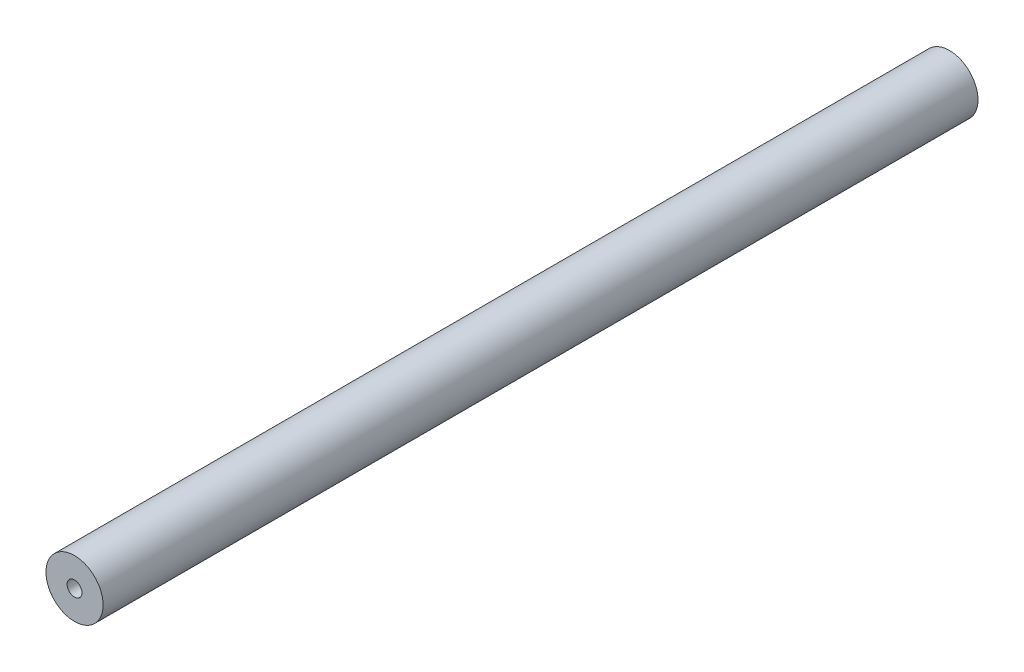
ISO-10303-21;
HEADER;
FILE_DESCRIPTION(('STEP AP214'),'2;1');
FILE_NAME('part.step','',(''),(''),'','','');
FILE_SCHEMA(('AUTOMOTIVE_DESIGN { 1 0 10303 214 1 1 1 1 }'));
ENDSEC;
DATA;
#1=APPLICATION_CONTEXT('core data for automotive mechanical design processes');
#2=APPLICATION_PROTOCOL_DEFINITION('international standard','automotive_design',2000,#1);
#3=PRODUCT_CONTEXT('',#1,'mechanical');
#4=PRODUCT('Part','Part','',(#3));
#5=PRODUCT_RELATED_PRODUCT_CATEGORY('part','',(#4));
#6=PRODUCT_DEFINITION_FORMATION('','',#4);
#7=PRODUCT_DEFINITION_CONTEXT('part definition',#1,'design');
#8=PRODUCT_DEFINITION('design','',#6,#7);
#9=PRODUCT_DEFINITION_SHAPE('','',#8);
#10=(LENGTH_UNIT() NAMED_UNIT(*) SI_UNIT(.MILLI.,.METRE.));
#11=(NAMED_UNIT(*) PLANE_ANGLE_UNIT() SI_UNIT($,.RADIAN.));
#12=(NAMED_UNIT(*) SI_UNIT($,.STERADIAN.) SOLID_ANGLE_UNIT());
#13=UNCERTAINTY_MEASURE_WITH_UNIT(LENGTH_MEASURE(1.E-05),#10,'distance_accuracy_value','');
#14=(GEOMETRIC_REPRESENTATION_CONTEXT(3) GLOBAL_UNCERTAINTY_ASSIGNED_CONTEXT((#13)) GLOBAL_UNIT_ASSIGNED_CONTEXT((#10,
#11,#12)) REPRESENTATION_CONTEXT('',''));
#15=CARTESIAN_POINT('',(0.,0.,0.));
#16=DIRECTION('',(0.,0.,1.));
#17=DIRECTION('',(1.,0.,0.));
#18=AXIS2_PLACEMENT_3D('',#15,#16,#17);
#19=CARTESIAN_POINT('',(0.,0.,233.3625));
#20=DIRECTION('',(0.,0.,1.));
#21=DIRECTION('',(1.,0.,0.));
#22=AXIS2_PLACEMENT_3D('',#19,#20,#21);
#23=PLANE('',#22);
#24=CARTESIAN_POINT('',(0.,0.,233.3625));
#25=DIRECTION('',(0.,0.,1.));
#26=DIRECTION('',(1.,0.,0.));
#27=AXIS2_PLACEMENT_3D('',#24,#25,#26);
#28=CIRCLE('',#27,15.24);
#29=CARTESIAN_POINT('',(15.24,0.,233.3625));
#30=VERTEX_POINT('',#29);
#31=EDGE_CURVE('E11',#30,#30,#28,.T.);
#32=ORIENTED_EDGE('',*,*,#31,.T.);
#33=EDGE_LOOP('',(#32));
#34=FACE_BOUND('',#33,.T.);
#35=CARTESIAN_POINT('',(0.,0.,233.3625));
#36=DIRECTION('',(0.,0.,1.));
#37=DIRECTION('',(1.,0.,0.));
#38=AXIS2_PLACEMENT_3D('',#35,#36,#37);
#39=CIRCLE('',#38,3.96875);
#40=CARTESIAN_POINT('',(3.96875,0.,233.3625));
#41=VERTEX_POINT('',#40);
#42=EDGE_CURVE('E48',#41,#41,#39,.T.);
#43=ORIENTED_EDGE('',*,*,#42,.F.);
#44=EDGE_LOOP('',(#43));
#45=FACE_BOUND('',#44,.T.);
#46=ADVANCED_FACE('F37',(#34,#45),#23,.T.);
#47=CARTESIAN_POINT('',(0.,0.,-233.3625));
#48=DIRECTION('',(0.,0.,1.));
#49=DIRECTION('',(1.,0.,0.));
#50=AXIS2_PLACEMENT_3D('',#47,#48,#49);
#51=PLANE('',#50);
#52=CARTESIAN_POINT('',(0.,0.,-233.3625));
#53=DIRECTION('',(0.,0.,1.));
#54=DIRECTION('',(1.,0.,0.));
#55=AXIS2_PLACEMENT_3D('',#52,#53,#54);
#56=CIRCLE('',#55,15.24);
#57=CARTESIAN_POINT('',(15.24,0.,-233.3625));
#58=VERTEX_POINT('',#57);
#59=EDGE_CURVE('E41',#58,#58,#56,.T.);
#60=ORIENTED_EDGE('',*,*,#59,.F.);
#61=EDGE_LOOP('',(#60));
#62=FACE_BOUND('',#61,.T.);
#63=CARTESIAN_POINT('',(0.,0.,-233.3625));
#64=DIRECTION('',(0.,0.,1.));
#65=DIRECTION('',(1.,0.,0.));
#66=AXIS2_PLACEMENT_3D('',#63,#64,#65);
#67=CIRCLE('',#66,3.96875);
#68=CARTESIAN_POINT('',(3.96875,0.,-233.3625));
#69=VERTEX_POINT('',#68);
#70=EDGE_CURVE('E50',#69,#69,#67,.T.);
#71=ORIENTED_EDGE('',*,*,#70,.T.);
#72=EDGE_LOOP('',(#71));
#73=FACE_BOUND('',#72,.T.);
#74=ADVANCED_FACE('F60',(#62,#73),#51,.F.);
#75=CARTESIAN_POINT('',(0.,0.,233.3625));
#76=DIRECTION('',(0.,0.,-1.));
#77=DIRECTION('',(-1.,0.,0.));
#78=AXIS2_PLACEMENT_3D('',#75,#76,#77);
#79=CYLINDRICAL_SURFACE('',#78,15.24);
#80=ORIENTED_EDGE('',*,*,#31,.F.);
#81=EDGE_LOOP('',(#80));
#82=FACE_BOUND('',#81,.T.);
#83=ORIENTED_EDGE('',*,*,#59,.T.);
#84=EDGE_LOOP('',(#83));
#85=FACE_BOUND('',#84,.T.);
#86=ADVANCED_FACE('F39',(#82,#85),#79,.T.);
#87=CARTESIAN_POINT('',(0.,0.,233.3625));
#88=DIRECTION('',(0.,0.,-1.));
#89=DIRECTION('',(-1.,0.,0.));
#90=AXIS2_PLACEMENT_3D('',#87,#88,#89);
#91=CYLINDRICAL_SURFACE('',#90,3.96875);
#92=ORIENTED_EDGE('',*,*,#42,.T.);
#93=EDGE_LOOP('',(#92));
#94=FACE_BOUND('',#93,.T.);
#95=ORIENTED_EDGE('',*,*,#70,.F.);
#96=EDGE_LOOP('',(#95));
#97=FACE_BOUND('',#96,.T.);
#98=ADVANCED_FACE('F56',(#94,#97),#91,.F.);
#99=CLOSED_SHELL('',(#46,#74,#86,#98));
#100=MANIFOLD_SOLID_BREP('B2',#99);
#101=ADVANCED_BREP_SHAPE_REPRESENTATION('',(#18,#100),#14);
#102=SHAPE_DEFINITION_REPRESENTATION(#9,#101);
ENDSEC;
END-ISO-10303-21;
